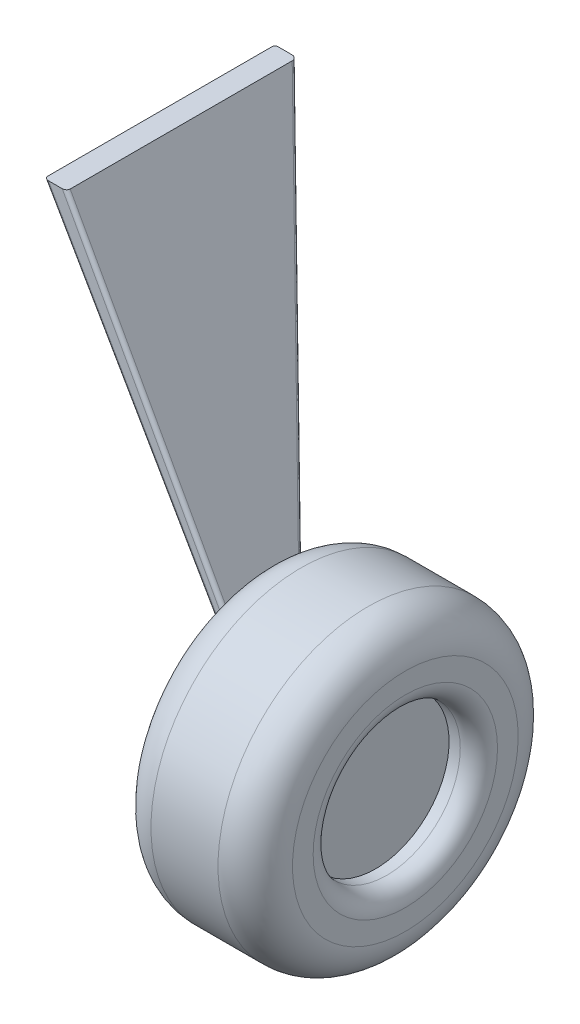
ISO-10303-21;
HEADER;
FILE_DESCRIPTION(('STEP AP214'),'2;1');
FILE_NAME('part.step','',(''),(''),'','','');
FILE_SCHEMA(('AUTOMOTIVE_DESIGN { 1 0 10303 214 1 1 1 1 }'));
ENDSEC;
DATA;
#1=APPLICATION_CONTEXT('core data for automotive mechanical design processes');
#2=APPLICATION_PROTOCOL_DEFINITION('international standard','automotive_design',2000,#1);
#3=PRODUCT_CONTEXT('',#1,'mechanical');
#4=PRODUCT('Part','Part','',(#3));
#5=PRODUCT_RELATED_PRODUCT_CATEGORY('part','',(#4));
#6=PRODUCT_DEFINITION_FORMATION('','',#4);
#7=PRODUCT_DEFINITION_CONTEXT('part definition',#1,'design');
#8=PRODUCT_DEFINITION('design','',#6,#7);
#9=PRODUCT_DEFINITION_SHAPE('','',#8);
#10=(LENGTH_UNIT() NAMED_UNIT(*) SI_UNIT(.MILLI.,.METRE.));
#11=(NAMED_UNIT(*) PLANE_ANGLE_UNIT() SI_UNIT($,.RADIAN.));
#12=(NAMED_UNIT(*) SI_UNIT($,.STERADIAN.) SOLID_ANGLE_UNIT());
#13=UNCERTAINTY_MEASURE_WITH_UNIT(LENGTH_MEASURE(1.E-05),#10,'distance_accuracy_value','');
#14=(GEOMETRIC_REPRESENTATION_CONTEXT(3) GLOBAL_UNCERTAINTY_ASSIGNED_CONTEXT((#13)) GLOBAL_UNIT_ASSIGNED_CONTEXT((#10,
#11,#12)) REPRESENTATION_CONTEXT('',''));
#15=CARTESIAN_POINT('',(0.,0.,0.));
#16=DIRECTION('',(0.,0.,1.));
#17=DIRECTION('',(1.,0.,0.));
#18=AXIS2_PLACEMENT_3D('',#15,#16,#17);
#19=CARTESIAN_POINT('',(190.,0.,0.));
#20=DIRECTION('',(-1.,0.,0.));
#21=DIRECTION('',(0.,0.,1.));
#22=AXIS2_PLACEMENT_3D('',#19,#20,#21);
#23=CYLINDRICAL_SURFACE('',#22,98.7680912777261);
#24=CARTESIAN_POINT('',(165.,0.,0.));
#25=DIRECTION('',(1.,0.,0.));
#26=DIRECTION('',(0.,0.,-1.));
#27=AXIS2_PLACEMENT_3D('',#24,#25,#26);
#28=CIRCLE('',#27,98.7680912777261);
#29=CARTESIAN_POINT('',(165.,0.,-98.7680912777261));
#30=VERTEX_POINT('',#29);
#31=EDGE_CURVE('E137',#30,#30,#28,.T.);
#32=ORIENTED_EDGE('',*,*,#31,.T.);
#33=EDGE_LOOP('',(#32));
#34=FACE_BOUND('',#33,.T.);
#35=CARTESIAN_POINT('',(150.,0.,0.));
#36=DIRECTION('',(-1.,0.,0.));
#37=DIRECTION('',(0.,0.,1.));
#38=AXIS2_PLACEMENT_3D('',#35,#36,#37);
#39=CIRCLE('',#38,98.7680912777261);
#40=CARTESIAN_POINT('',(150.,0.,98.7680912777261));
#41=VERTEX_POINT('',#40);
#42=EDGE_CURVE('E172',#41,#41,#39,.T.);
#43=ORIENTED_EDGE('',*,*,#42,.T.);
#44=EDGE_LOOP('',(#43));
#45=FACE_BOUND('',#44,.T.);
#46=ADVANCED_FACE('F40',(#34,#45),#23,.F.);
#47=CARTESIAN_POINT('',(190.,0.,0.));
#48=DIRECTION('',(1.,0.,0.));
#49=DIRECTION('',(0.,0.,-1.));
#50=AXIS2_PLACEMENT_3D('',#47,#48,#49);
#51=PLANE('',#50);
#52=CARTESIAN_POINT('',(190.,0.,0.));
#53=DIRECTION('',(1.,0.,0.));
#54=DIRECTION('',(0.,0.,-1.));
#55=AXIS2_PLACEMENT_3D('',#52,#53,#54);
#56=CIRCLE('',#55,123.768091277726);
#57=CARTESIAN_POINT('',(190.,0.,-123.768091277726));
#58=VERTEX_POINT('',#57);
#59=EDGE_CURVE('E132',#58,#58,#56,.F.);
#60=ORIENTED_EDGE('',*,*,#59,.T.);
#61=EDGE_LOOP('',(#60));
#62=FACE_BOUND('',#61,.T.);
#63=CARTESIAN_POINT('',(190.,0.,0.));
#64=DIRECTION('',(1.,0.,0.));
#65=DIRECTION('',(0.,0.,-1.));
#66=AXIS2_PLACEMENT_3D('',#63,#64,#65);
#67=CIRCLE('',#66,151.5);
#68=CARTESIAN_POINT('',(190.,0.,-151.5));
#69=VERTEX_POINT('',#68);
#70=EDGE_CURVE('E175',#69,#69,#67,.T.);
#71=ORIENTED_EDGE('',*,*,#70,.T.);
#72=EDGE_LOOP('',(#71));
#73=FACE_BOUND('',#72,.T.);
#74=ADVANCED_FACE('F210',(#62,#73),#51,.T.);
#75=CARTESIAN_POINT('',(0.,0.,0.));
#76=DIRECTION('',(1.,0.,0.));
#77=DIRECTION('',(0.,0.,-1.));
#78=AXIS2_PLACEMENT_3D('',#75,#76,#77);
#79=PLANE('',#78);
#80=DIRECTION('',(0.,0.,1.));
#81=VECTOR('',#80,1.);
#82=CARTESIAN_POINT('',(0.,-30.,-310.));
#83=LINE('',#82,#81);
#84=CARTESIAN_POINT('',(0.,-30.,-35.6638111282898));
#85=VERTEX_POINT('',#84);
#86=CARTESIAN_POINT('',(0.,-30.,-5.));
#87=VERTEX_POINT('',#86);
#88=EDGE_CURVE('E176',#85,#87,#83,.T.);
#89=ORIENTED_EDGE('',*,*,#88,.F.);
#90=CARTESIAN_POINT('',(0.,-19.9854034991053,-39.6289018288809));
#91=DIRECTION('',(1.,0.,0.));
#92=DIRECTION('',(0.,-0.884524070008096,0.466494554712392));
#93=AXIS2_PLACEMENT_3D('',#90,#91,#92);
#94=ELLIPSE('',#93,11.0106494380479,5.);
#95=CARTESIAN_POINT('',(0.,-22.3178762726668,-44.0515221789215));
#96=VERTEX_POINT('',#95);
#97=EDGE_CURVE('E157',#85,#96,#94,.T.);
#98=ORIENTED_EDGE('',*,*,#97,.T.);
#99=DIRECTION('',(0.,0.884524070008096,-0.466494554712392));
#100=VECTOR('',#99,1.);
#101=CARTESIAN_POINT('',(0.,481.949167444037,-310.));
#102=LINE('',#101,#100);
#103=CARTESIAN_POINT('',(0.,-12.7098312641278,-49.1187677518702));
#104=VERTEX_POINT('',#103);
#105=EDGE_CURVE('E163',#96,#104,#102,.T.);
#106=ORIENTED_EDGE('',*,*,#105,.T.);
#107=CARTESIAN_POINT('',(0.,-10.377358490566,-44.6961474018296));
#108=DIRECTION('',(1.,0.,0.));
#109=DIRECTION('',(0.,0.884524070008096,-0.466494554712392));
#110=AXIS2_PLACEMENT_3D('',#107,#108,#109);
#111=ELLIPSE('',#110,11.4319463163367,5.);
#112=CARTESIAN_POINT('',(0.,0.,-48.8985807366459));
#113=VERTEX_POINT('',#112);
#114=EDGE_CURVE('E131',#104,#113,#111,.T.);
#115=ORIENTED_EDGE('',*,*,#114,.T.);
#116=DIRECTION('',(0.,0.,1.));
#117=VECTOR('',#116,1.);
#118=CARTESIAN_POINT('',(0.,0.,-310.));
#119=LINE('',#118,#117);
#120=CARTESIAN_POINT('',(0.,0.,-5.));
#121=VERTEX_POINT('',#120);
#122=EDGE_CURVE('E127',#113,#121,#119,.T.);
#123=ORIENTED_EDGE('',*,*,#122,.T.);
#124=CARTESIAN_POINT('',(0.,-10.377358490566,-5.));
#125=DIRECTION('',(1.,0.,0.));
#126=DIRECTION('',(0.,1.,0.));
#127=AXIS2_PLACEMENT_3D('',#124,#125,#126);
#128=ELLIPSE('',#127,10.377358490566,5.);
#129=CARTESIAN_POINT('',(0.,-10.3773584905661,0.));
#130=VERTEX_POINT('',#129);
#131=EDGE_CURVE('E48',#121,#130,#128,.T.);
#132=ORIENTED_EDGE('',*,*,#131,.T.);
#133=DIRECTION('',(0.,1.,0.));
#134=VECTOR('',#133,1.);
#135=CARTESIAN_POINT('',(0.,-30.,0.));
#136=LINE('',#135,#134);
#137=CARTESIAN_POINT('',(0.,-19.9854034991052,0.));
#138=VERTEX_POINT('',#137);
#139=EDGE_CURVE('E374',#138,#130,#136,.T.);
#140=ORIENTED_EDGE('',*,*,#139,.F.);
#141=CARTESIAN_POINT('',(0.,-19.9854034991052,-5.));
#142=DIRECTION('',(1.,0.,0.));
#143=DIRECTION('',(0.,-1.,0.));
#144=AXIS2_PLACEMENT_3D('',#141,#142,#143);
#145=ELLIPSE('',#144,10.014596500895,5.);
#146=EDGE_CURVE('E11',#138,#87,#145,.T.);
#147=ORIENTED_EDGE('',*,*,#146,.T.);
#148=EDGE_LOOP('',(#89,#98,#106,#115,#123,#132,#140,#147));
#149=FACE_BOUND('',#148,.T.);
#150=CARTESIAN_POINT('',(0.,0.,0.));
#151=DIRECTION('',(1.,0.,0.));
#152=DIRECTION('',(0.,0.,-1.));
#153=AXIS2_PLACEMENT_3D('',#150,#151,#152);
#154=CIRCLE('',#153,151.5);
#155=CARTESIAN_POINT('',(0.,0.,-151.5));
#156=VERTEX_POINT('',#155);
#157=EDGE_CURVE('E185',#156,#156,#154,.F.);
#158=ORIENTED_EDGE('',*,*,#157,.T.);
#159=EDGE_LOOP('',(#158));
#160=FACE_BOUND('',#159,.T.);
#161=ADVANCED_FACE('F161',(#149,#160),#79,.F.);
#162=CARTESIAN_POINT('',(190.,0.,0.));
#163=DIRECTION('',(-1.,0.,0.));
#164=DIRECTION('',(0.,0.,1.));
#165=AXIS2_PLACEMENT_3D('',#162,#163,#164);
#166=CYLINDRICAL_SURFACE('',#165,201.5);
#167=CARTESIAN_POINT('',(140.,0.,0.));
#168=DIRECTION('',(1.,0.,0.));
#169=DIRECTION('',(0.,0.,-1.));
#170=AXIS2_PLACEMENT_3D('',#167,#168,#169);
#171=CIRCLE('',#170,201.5);
#172=CARTESIAN_POINT('',(140.,0.,-201.5));
#173=VERTEX_POINT('',#172);
#174=EDGE_CURVE('E182',#173,#173,#171,.F.);
#175=ORIENTED_EDGE('',*,*,#174,.T.);
#176=EDGE_LOOP('',(#175));
#177=FACE_BOUND('',#176,.T.);
#178=CARTESIAN_POINT('',(50.,0.,0.));
#179=DIRECTION('',(1.,0.,0.));
#180=DIRECTION('',(0.,0.,-1.));
#181=AXIS2_PLACEMENT_3D('',#178,#179,#180);
#182=CIRCLE('',#181,201.5);
#183=CARTESIAN_POINT('',(50.,0.,-201.5));
#184=VERTEX_POINT('',#183);
#185=EDGE_CURVE('E179',#184,#184,#182,.T.);
#186=ORIENTED_EDGE('',*,*,#185,.T.);
#187=EDGE_LOOP('',(#186));
#188=FACE_BOUND('',#187,.T.);
#189=ADVANCED_FACE('F223',(#177,#188),#166,.T.);
#190=CARTESIAN_POINT('',(150.,0.,0.));
#191=DIRECTION('',(-1.,0.,0.));
#192=DIRECTION('',(0.,0.,1.));
#193=AXIS2_PLACEMENT_3D('',#190,#191,#192);
#194=PLANE('',#193);
#195=ORIENTED_EDGE('',*,*,#42,.F.);
#196=EDGE_LOOP('',(#195));
#197=FACE_BOUND('',#196,.T.);
#198=ADVANCED_FACE('F218',(#197),#194,.F.);
#199=CARTESIAN_POINT('',(140.,0.,0.));
#200=DIRECTION('',(1.,0.,0.));
#201=DIRECTION('',(0.,0.,-1.));
#202=AXIS2_PLACEMENT_3D('',#199,#200,#201);
#203=TOROIDAL_SURFACE('',#202,151.5,50.);
#204=ORIENTED_EDGE('',*,*,#174,.F.);
#205=EDGE_LOOP('',(#204));
#206=FACE_BOUND('',#205,.T.);
#207=ORIENTED_EDGE('',*,*,#70,.F.);
#208=EDGE_LOOP('',(#207));
#209=FACE_BOUND('',#208,.T.);
#210=ADVANCED_FACE('F204',(#206,#209),#203,.T.);
#211=CARTESIAN_POINT('',(50.,0.,0.));
#212=DIRECTION('',(1.,0.,0.));
#213=DIRECTION('',(0.,0.,-1.));
#214=AXIS2_PLACEMENT_3D('',#211,#212,#213);
#215=TOROIDAL_SURFACE('',#214,151.5,50.);
#216=ORIENTED_EDGE('',*,*,#157,.F.);
#217=EDGE_LOOP('',(#216));
#218=FACE_BOUND('',#217,.T.);
#219=ORIENTED_EDGE('',*,*,#185,.F.);
#220=EDGE_LOOP('',(#219));
#221=FACE_BOUND('',#220,.T.);
#222=ADVANCED_FACE('F195',(#218,#221),#215,.T.);
#223=CARTESIAN_POINT('',(165.,0.,0.));
#224=DIRECTION('',(1.,0.,0.));
#225=DIRECTION('',(0.,0.,-1.));
#226=AXIS2_PLACEMENT_3D('',#223,#224,#225);
#227=TOROIDAL_SURFACE('',#226,123.768091277726,25.);
#228=ORIENTED_EDGE('',*,*,#59,.F.);
#229=EDGE_LOOP('',(#228));
#230=FACE_BOUND('',#229,.T.);
#231=ORIENTED_EDGE('',*,*,#31,.F.);
#232=EDGE_LOOP('',(#231));
#233=FACE_BOUND('',#232,.T.);
#234=ADVANCED_FACE('F192',(#230,#233),#227,.T.);
#235=CARTESIAN_POINT('',(-295.,481.949167444037,-310.));
#236=DIRECTION('',(-0.866445745684745,-0.499271238691761,0.));
#237=DIRECTION('',(0.499271238691761,-0.866445745684746,0.));
#238=AXIS2_PLACEMENT_3D('',#235,#236,#237);
#239=PLANE('',#238);
#240=DIRECTION('',(0.,0.,1.));
#241=VECTOR('',#240,1.);
#242=CARTESIAN_POINT('',(-295.,481.949167444037,-310.));
#243=LINE('',#242,#241);
#244=CARTESIAN_POINT('',(-295.,481.949167444037,-305.66381112829));
#245=VERTEX_POINT('',#244);
#246=CARTESIAN_POINT('',(-295.,481.949167444037,-5.));
#247=VERTEX_POINT('',#246);
#248=EDGE_CURVE('E168',#245,#247,#243,.T.);
#249=ORIENTED_EDGE('',*,*,#248,.F.);
#250=DIRECTION('',(-0.45410582074498,0.788064735125029,-0.41562227661405));
#251=VECTOR('',#250,1.);
#252=CARTESIAN_POINT('',(-0.818397089485431,-28.5797365810146,-36.4128525322256));
#253=LINE('',#252,#251);
#254=EDGE_CURVE('E146',#245,#85,#253,.F.);
#255=ORIENTED_EDGE('',*,*,#254,.T.);
#256=ORIENTED_EDGE('',*,*,#88,.T.);
#257=DIRECTION('',(0.499271238691761,-0.866445745684746,0.));
#258=VECTOR('',#257,1.);
#259=CARTESIAN_POINT('',(-295.,481.949167444037,-5.));
#260=LINE('',#259,#258);
#261=EDGE_CURVE('E144',#87,#247,#260,.F.);
#262=ORIENTED_EDGE('',*,*,#261,.T.);
#263=EDGE_LOOP('',(#249,#255,#256,#262));
#264=FACE_BOUND('',#263,.T.);
#265=ADVANCED_FACE('F194',(#264),#239,.T.);
#266=CARTESIAN_POINT('',(-265.,481.949167444037,-310.));
#267=DIRECTION('',(0.,1.,0.));
#268=DIRECTION('',(-1.,0.,0.));
#269=AXIS2_PLACEMENT_3D('',#266,#267,#268);
#270=PLANE('',#269);
#271=DIRECTION('',(-1.,0.,0.));
#272=VECTOR('',#271,1.);
#273=CARTESIAN_POINT('',(-265.,481.949167444037,-310.));
#274=LINE('',#273,#272);
#275=CARTESIAN_POINT('',(-271.98850732092,481.949167444037,-310.));
#276=VERTEX_POINT('',#275);
#277=CARTESIAN_POINT('',(-290.573336878586,481.949167444037,-310.));
#278=VERTEX_POINT('',#277);
#279=EDGE_CURVE('E109',#276,#278,#274,.T.);
#280=ORIENTED_EDGE('',*,*,#279,.T.);
#281=CARTESIAN_POINT('',(-289.22929822796,481.949167444037,-304.347242579895));
#282=DIRECTION('',(0.,1.,0.));
#283=DIRECTION('',(0.737672912354376,0.,0.67515825876502));
#284=AXIS2_PLACEMENT_3D('',#281,#282,#283);
#285=ELLIPSE('',#284,6.34465644399979,5.);
#286=EDGE_CURVE('E115',#278,#245,#285,.T.);
#287=ORIENTED_EDGE('',*,*,#286,.T.);
#288=ORIENTED_EDGE('',*,*,#248,.T.);
#289=CARTESIAN_POINT('',(-289.229298227959,481.949167444037,-5.));
#290=DIRECTION('',(0.,1.,0.));
#291=DIRECTION('',(1.,0.,0.));
#292=AXIS2_PLACEMENT_3D('',#289,#290,#291);
#293=ELLIPSE('',#292,5.77070177204061,5.);
#294=CARTESIAN_POINT('',(-289.229298227959,481.949167444037,0.));
#295=VERTEX_POINT('',#294);
#296=EDGE_CURVE('E134',#247,#295,#293,.T.);
#297=ORIENTED_EDGE('',*,*,#296,.T.);
#298=DIRECTION('',(-1.,0.,0.));
#299=VECTOR('',#298,1.);
#300=CARTESIAN_POINT('',(-265.,481.949167444037,0.));
#301=LINE('',#300,#299);
#302=CARTESIAN_POINT('',(-270.705995955101,481.949167444037,0.));
#303=VERTEX_POINT('',#302);
#304=EDGE_CURVE('E128',#303,#295,#301,.T.);
#305=ORIENTED_EDGE('',*,*,#304,.F.);
#306=CARTESIAN_POINT('',(-270.705995955101,481.949167444037,-5.));
#307=DIRECTION('',(0.,1.,0.));
#308=DIRECTION('',(-1.,0.,0.));
#309=AXIS2_PLACEMENT_3D('',#306,#307,#308);
#310=ELLIPSE('',#309,5.70599595510107,5.);
#311=CARTESIAN_POINT('',(-265.,481.949167444037,-5.));
#312=VERTEX_POINT('',#311);
#313=EDGE_CURVE('E116',#303,#312,#310,.T.);
#314=ORIENTED_EDGE('',*,*,#313,.T.);
#315=DIRECTION('',(0.,0.,1.));
#316=VECTOR('',#315,1.);
#317=CARTESIAN_POINT('',(-265.,481.949167444037,-310.));
#318=LINE('',#317,#316);
#319=CARTESIAN_POINT('',(-265.,481.949167444037,-303.076697403111));
#320=VERTEX_POINT('',#319);
#321=EDGE_CURVE('E111',#320,#312,#318,.T.);
#322=ORIENTED_EDGE('',*,*,#321,.F.);
#323=CARTESIAN_POINT('',(-270.705995955101,481.949167444037,-304.347242579895));
#324=DIRECTION('',(0.,1.,0.));
#325=DIRECTION('',(-0.7216891344921,0.,-0.692217301976802));
#326=AXIS2_PLACEMENT_3D('',#323,#324,#325);
#327=ELLIPSE('',#326,6.28586161875883,5.);
#328=EDGE_CURVE('E106',#320,#276,#327,.T.);
#329=ORIENTED_EDGE('',*,*,#328,.T.);
#330=EDGE_LOOP('',(#280,#287,#288,#297,#305,#314,#322,#329));
#331=FACE_BOUND('',#330,.T.);
#332=ADVANCED_FACE('F108',(#331),#270,.T.);
#333=CARTESIAN_POINT('',(0.,0.,-310.));
#334=DIRECTION('',(0.876271213534612,0.481818181818182,0.));
#335=DIRECTION('',(-0.481818181818182,0.876271213534612,0.));
#336=AXIS2_PLACEMENT_3D('',#333,#334,#335);
#337=PLANE('',#336);
#338=ORIENTED_EDGE('',*,*,#122,.F.);
#339=DIRECTION('',(0.437370843218078,-0.795435900955656,0.419509800807527));
#340=VECTOR('',#339,1.);
#341=CARTESIAN_POINT('',(-266.27029694375,484.259426140063,-304.295118855071));
#342=LINE('',#341,#340);
#343=EDGE_CURVE('E150',#113,#320,#342,.F.);
#344=ORIENTED_EDGE('',*,*,#343,.T.);
#345=ORIENTED_EDGE('',*,*,#321,.T.);
#346=DIRECTION('',(-0.481818181818182,0.876271213534612,0.));
#347=VECTOR('',#346,1.);
#348=CARTESIAN_POINT('',(0.,0.,-5.));
#349=LINE('',#348,#347);
#350=EDGE_CURVE('E148',#312,#121,#349,.F.);
#351=ORIENTED_EDGE('',*,*,#350,.T.);
#352=EDGE_LOOP('',(#338,#344,#345,#351));
#353=FACE_BOUND('',#352,.T.);
#354=ADVANCED_FACE('F165',(#353),#337,.T.);
#355=CARTESIAN_POINT('',(0.,0.,0.));
#356=DIRECTION('',(0.,0.,1.));
#357=DIRECTION('',(1.,0.,0.));
#358=AXIS2_PLACEMENT_3D('',#355,#356,#357);
#359=PLANE('',#358);
#360=ORIENTED_EDGE('',*,*,#139,.T.);
#361=DIRECTION('',(-0.481818181818182,0.876271213534612,0.));
#362=VECTOR('',#361,1.);
#363=CARTESIAN_POINT('',(-4.38135606767309,-2.40909090909092,0.));
#364=LINE('',#363,#362);
#365=EDGE_CURVE('E154',#130,#303,#364,.T.);
#366=ORIENTED_EDGE('',*,*,#365,.T.);
#367=ORIENTED_EDGE('',*,*,#304,.T.);
#368=DIRECTION('',(0.499271238691761,-0.866445745684746,0.));
#369=VECTOR('',#368,1.);
#370=CARTESIAN_POINT('',(-8.64551449279323,-4.9817969000854,0.));
#371=LINE('',#370,#369);
#372=EDGE_CURVE('E152',#295,#138,#371,.T.);
#373=ORIENTED_EDGE('',*,*,#372,.T.);
#374=EDGE_LOOP('',(#360,#366,#367,#373));
#375=FACE_BOUND('',#374,.T.);
#376=ADVANCED_FACE('F305',(#375),#359,.T.);
#377=CARTESIAN_POINT('',(0.,481.949167444037,-310.));
#378=DIRECTION('',(0.,0.466494554712392,0.884524070008096));
#379=DIRECTION('',(0.,-0.884524070008096,0.466494554712392));
#380=AXIS2_PLACEMENT_3D('',#377,#378,#379);
#381=PLANE('',#380);
#382=ORIENTED_EDGE('',*,*,#105,.F.);
#383=DIRECTION('',(-0.45410582074498,0.788064735125029,-0.41562227661405));
#384=VECTOR('',#383,1.);
#385=CARTESIAN_POINT('',(-291.486168361062,483.533314282919,-310.835472882266));
#386=LINE('',#385,#384);
#387=EDGE_CURVE('E126',#96,#278,#386,.T.);
#388=ORIENTED_EDGE('',*,*,#387,.T.);
#389=ORIENTED_EDGE('',*,*,#279,.F.);
#390=DIRECTION('',(0.437370843218078,-0.795435900955656,0.419509800807527));
#391=VECTOR('',#390,1.);
#392=CARTESIAN_POINT('',(-5.65165301142301,-2.43130498662648,-54.539622538647));
#393=LINE('',#392,#391);
#394=EDGE_CURVE('E123',#276,#104,#393,.T.);
#395=ORIENTED_EDGE('',*,*,#394,.T.);
#396=EDGE_LOOP('',(#382,#388,#389,#395));
#397=FACE_BOUND('',#396,.T.);
#398=ADVANCED_FACE('F122',(#397),#381,.F.);
#399=CARTESIAN_POINT('',(-230.653599912893,380.295675969963,-250.735586494918));
#400=DIRECTION('',(0.45410582074498,-0.788064735125029,0.41562227661405));
#401=DIRECTION('',(0.866445745684746,0.499271238691761,0.));
#402=AXIS2_PLACEMENT_3D('',#399,#400,#401);
#403=CYLINDRICAL_SURFACE('',#402,5.);
#404=ORIENTED_EDGE('',*,*,#97,.F.);
#405=ORIENTED_EDGE('',*,*,#254,.F.);
#406=ORIENTED_EDGE('',*,*,#286,.F.);
#407=ORIENTED_EDGE('',*,*,#387,.F.);
#408=EDGE_LOOP('',(#404,#405,#406,#407));
#409=FACE_BOUND('',#408,.T.);
#410=ADVANCED_FACE('F321',(#409),#403,.T.);
#411=CARTESIAN_POINT('',(-219.958940569641,389.656710488342,-255.672559695951));
#412=DIRECTION('',(-0.437370843218078,0.795435900955656,-0.419509800807527));
#413=DIRECTION('',(-0.876271213534612,-0.481818181818182,0.));
#414=AXIS2_PLACEMENT_3D('',#411,#412,#413);
#415=CYLINDRICAL_SURFACE('',#414,5.);
#416=ORIENTED_EDGE('',*,*,#328,.F.);
#417=ORIENTED_EDGE('',*,*,#343,.F.);
#418=ORIENTED_EDGE('',*,*,#114,.F.);
#419=ORIENTED_EDGE('',*,*,#394,.F.);
#420=EDGE_LOOP('',(#416,#417,#418,#419));
#421=FACE_BOUND('',#420,.T.);
#422=ADVANCED_FACE('F130',(#421),#415,.T.);
#423=CARTESIAN_POINT('',(-4.38135606767306,-2.40909090909091,-5.));
#424=DIRECTION('',(-0.481818181818182,0.876271213534612,0.));
#425=DIRECTION('',(-0.876271213534612,-0.481818181818182,0.));
#426=AXIS2_PLACEMENT_3D('',#423,#424,#425);
#427=CYLINDRICAL_SURFACE('',#426,5.);
#428=ORIENTED_EDGE('',*,*,#131,.F.);
#429=ORIENTED_EDGE('',*,*,#350,.F.);
#430=ORIENTED_EDGE('',*,*,#313,.F.);
#431=ORIENTED_EDGE('',*,*,#365,.F.);
#432=EDGE_LOOP('',(#428,#429,#430,#431));
#433=FACE_BOUND('',#432,.T.);
#434=ADVANCED_FACE('F339',(#433),#427,.T.);
#435=CARTESIAN_POINT('',(-8.64551449279323,-4.9817969000854,-5.));
#436=DIRECTION('',(0.499271238691761,-0.866445745684746,0.));
#437=DIRECTION('',(0.866445745684745,0.499271238691761,0.));
#438=AXIS2_PLACEMENT_3D('',#435,#436,#437);
#439=CYLINDRICAL_SURFACE('',#438,5.);
#440=ORIENTED_EDGE('',*,*,#296,.F.);
#441=ORIENTED_EDGE('',*,*,#261,.F.);
#442=ORIENTED_EDGE('',*,*,#146,.F.);
#443=ORIENTED_EDGE('',*,*,#372,.F.);
#444=EDGE_LOOP('',(#440,#441,#442,#443));
#445=FACE_BOUND('',#444,.T.);
#446=ADVANCED_FACE('F42',(#445),#439,.T.);
#447=CLOSED_SHELL('',(#46,#74,#161,#189,#198,#210,#222,#234,#265,#332,#354,#376,#398,#410,#422,
#434,#446));
#448=MANIFOLD_SOLID_BREP('B2',#447);
#449=ADVANCED_BREP_SHAPE_REPRESENTATION('',(#18,#448),#14);
#450=SHAPE_DEFINITION_REPRESENTATION(#9,#449);
ENDSEC;
END-ISO-10303-21;
